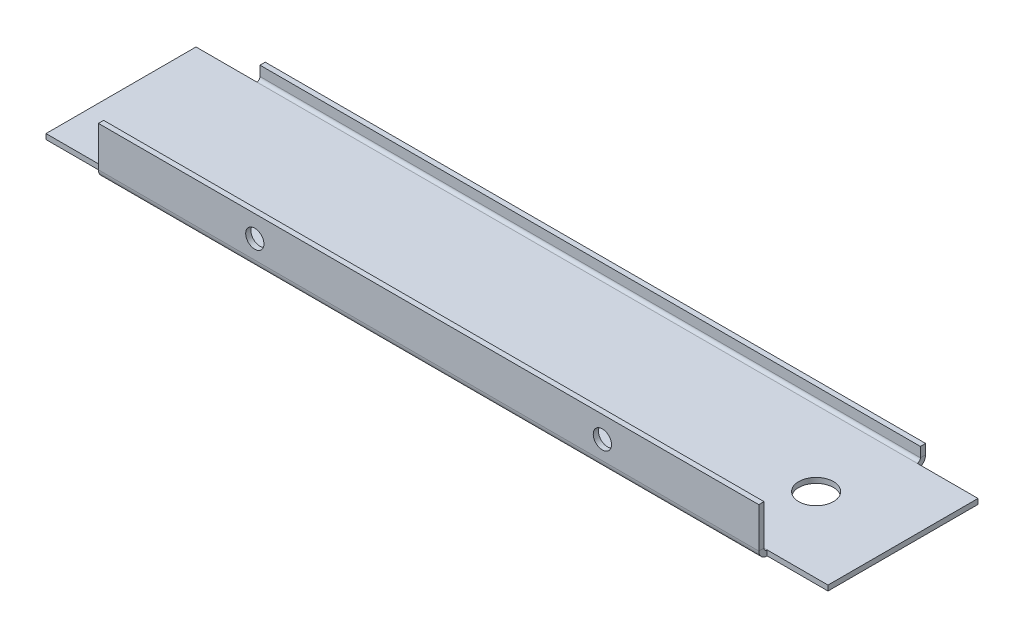
ISO-10303-21;
HEADER;
FILE_DESCRIPTION(('STEP AP214'),'2;1');
FILE_NAME('part.step','',(''),(''),'','','');
FILE_SCHEMA(('AUTOMOTIVE_DESIGN { 1 0 10303 214 1 1 1 1 }'));
ENDSEC;
DATA;
#1=APPLICATION_CONTEXT('core data for automotive mechanical design processes');
#2=APPLICATION_PROTOCOL_DEFINITION('international standard','automotive_design',2000,#1);
#3=PRODUCT_CONTEXT('',#1,'mechanical');
#4=PRODUCT('Part','Part','',(#3));
#5=PRODUCT_RELATED_PRODUCT_CATEGORY('part','',(#4));
#6=PRODUCT_DEFINITION_FORMATION('','',#4);
#7=PRODUCT_DEFINITION_CONTEXT('part definition',#1,'design');
#8=PRODUCT_DEFINITION('design','',#6,#7);
#9=PRODUCT_DEFINITION_SHAPE('','',#8);
#10=(LENGTH_UNIT() NAMED_UNIT(*) SI_UNIT(.MILLI.,.METRE.));
#11=(NAMED_UNIT(*) PLANE_ANGLE_UNIT() SI_UNIT($,.RADIAN.));
#12=(NAMED_UNIT(*) SI_UNIT($,.STERADIAN.) SOLID_ANGLE_UNIT());
#13=UNCERTAINTY_MEASURE_WITH_UNIT(LENGTH_MEASURE(1.E-05),#10,'distance_accuracy_value','');
#14=(GEOMETRIC_REPRESENTATION_CONTEXT(3) GLOBAL_UNCERTAINTY_ASSIGNED_CONTEXT((#13)) GLOBAL_UNIT_ASSIGNED_CONTEXT((#10,
#11,#12)) REPRESENTATION_CONTEXT('',''));
#15=CARTESIAN_POINT('',(0.,0.,0.));
#16=DIRECTION('',(0.,0.,1.));
#17=DIRECTION('',(1.,0.,0.));
#18=AXIS2_PLACEMENT_3D('',#15,#16,#17);
#19=CARTESIAN_POINT('',(90.,0.,-19.2));
#20=DIRECTION('',(0.,0.,1.));
#21=DIRECTION('',(0.,-1.,0.));
#22=AXIS2_PLACEMENT_3D('',#19,#20,#21);
#23=PLANE('',#22);
#24=DIRECTION('',(0.,-1.,0.));
#25=VECTOR('',#24,1.);
#26=CARTESIAN_POINT('',(76.,0.,-19.2));
#27=LINE('',#26,#25);
#28=CARTESIAN_POINT('',(76.,3.,-19.2));
#29=VERTEX_POINT('',#28);
#30=CARTESIAN_POINT('',(76.,0.7366,-19.2));
#31=VERTEX_POINT('',#30);
#32=EDGE_CURVE('E172',#29,#31,#27,.T.);
#33=ORIENTED_EDGE('',*,*,#32,.T.);
#34=DIRECTION('',(-1.,0.,0.));
#35=VECTOR('',#34,1.);
#36=CARTESIAN_POINT('',(90.,0.736599999999998,-19.2));
#37=LINE('',#36,#35);
#38=CARTESIAN_POINT('',(-75.9999999999999,0.736599999999998,-19.2));
#39=VERTEX_POINT('',#38);
#40=EDGE_CURVE('E50',#31,#39,#37,.T.);
#41=ORIENTED_EDGE('',*,*,#40,.T.);
#42=DIRECTION('',(0.,-1.,0.));
#43=VECTOR('',#42,1.);
#44=CARTESIAN_POINT('',(-75.9999999999999,0.,-19.2));
#45=LINE('',#44,#43);
#46=CARTESIAN_POINT('',(-75.9999999999999,3.,-19.2));
#47=VERTEX_POINT('',#46);
#48=EDGE_CURVE('E285',#39,#47,#45,.F.);
#49=ORIENTED_EDGE('',*,*,#48,.T.);
#50=DIRECTION('',(-1.,0.,0.));
#51=VECTOR('',#50,1.);
#52=CARTESIAN_POINT('',(90.,3.,-19.2));
#53=LINE('',#52,#51);
#54=EDGE_CURVE('E213',#29,#47,#53,.T.);
#55=ORIENTED_EDGE('',*,*,#54,.F.);
#56=EDGE_LOOP('',(#33,#41,#49,#55));
#57=FACE_BOUND('',#56,.T.);
#58=ADVANCED_FACE('F35',(#57),#23,.F.);
#59=CARTESIAN_POINT('',(90.,3.,-18.));
#60=DIRECTION('',(0.,1.,0.));
#61=DIRECTION('',(0.,0.,1.));
#62=AXIS2_PLACEMENT_3D('',#59,#60,#61);
#63=PLANE('',#62);
#64=DIRECTION('',(-1.,0.,0.));
#65=VECTOR('',#64,1.);
#66=CARTESIAN_POINT('',(90.,3.,-18.));
#67=LINE('',#66,#65);
#68=CARTESIAN_POINT('',(76.,3.,-18.));
#69=VERTEX_POINT('',#68);
#70=CARTESIAN_POINT('',(-76.,3.,-18.));
#71=VERTEX_POINT('',#70);
#72=EDGE_CURVE('E211',#69,#71,#67,.T.);
#73=ORIENTED_EDGE('',*,*,#72,.F.);
#74=DIRECTION('',(0.,0.,-1.));
#75=VECTOR('',#74,1.);
#76=CARTESIAN_POINT('',(76.,3.,-19.2));
#77=LINE('',#76,#75);
#78=EDGE_CURVE('E303',#29,#69,#77,.F.);
#79=ORIENTED_EDGE('',*,*,#78,.F.);
#80=ORIENTED_EDGE('',*,*,#54,.T.);
#81=DIRECTION('',(0.,0.,1.));
#82=VECTOR('',#81,1.);
#83=CARTESIAN_POINT('',(-76.,3.,-18.));
#84=LINE('',#83,#82);
#85=EDGE_CURVE('E279',#71,#47,#84,.F.);
#86=ORIENTED_EDGE('',*,*,#85,.F.);
#87=EDGE_LOOP('',(#73,#79,#80,#86));
#88=FACE_BOUND('',#87,.T.);
#89=ADVANCED_FACE('F385',(#88),#63,.T.);
#90=CARTESIAN_POINT('',(90.,0.,-18.));
#91=DIRECTION('',(0.,0.,1.));
#92=DIRECTION('',(0.,-1.,0.));
#93=AXIS2_PLACEMENT_3D('',#90,#91,#92);
#94=PLANE('',#93);
#95=DIRECTION('',(-1.,0.,0.));
#96=VECTOR('',#95,1.);
#97=CARTESIAN_POINT('',(90.,0.736599999999999,-18.));
#98=LINE('',#97,#96);
#99=CARTESIAN_POINT('',(76.,0.736599999999999,-18.));
#100=VERTEX_POINT('',#99);
#101=CARTESIAN_POINT('',(-76.,0.7366,-18.));
#102=VERTEX_POINT('',#101);
#103=EDGE_CURVE('E209',#100,#102,#98,.T.);
#104=ORIENTED_EDGE('',*,*,#103,.F.);
#105=DIRECTION('',(0.,-1.,0.));
#106=VECTOR('',#105,1.);
#107=CARTESIAN_POINT('',(76.,0.,-18.));
#108=LINE('',#107,#106);
#109=EDGE_CURVE('E305',#69,#100,#108,.T.);
#110=ORIENTED_EDGE('',*,*,#109,.F.);
#111=ORIENTED_EDGE('',*,*,#72,.T.);
#112=DIRECTION('',(0.,1.,0.));
#113=VECTOR('',#112,1.);
#114=CARTESIAN_POINT('',(-76.,0.,-18.));
#115=LINE('',#114,#113);
#116=EDGE_CURVE('E288',#102,#71,#115,.T.);
#117=ORIENTED_EDGE('',*,*,#116,.F.);
#118=EDGE_LOOP('',(#104,#110,#111,#117));
#119=FACE_BOUND('',#118,.T.);
#120=ADVANCED_FACE('F390',(#119),#94,.T.);
#121=CARTESIAN_POINT('',(90.,0.7366,-17.2634));
#122=DIRECTION('',(-1.,0.,0.));
#123=DIRECTION('',(0.,0.,1.));
#124=AXIS2_PLACEMENT_3D('',#121,#122,#123);
#125=CYLINDRICAL_SURFACE('',#124,0.7366);
#126=DIRECTION('',(-1.,0.,0.));
#127=VECTOR('',#126,1.);
#128=CARTESIAN_POINT('',(90.,0.,-17.2634));
#129=LINE('',#128,#127);
#130=CARTESIAN_POINT('',(76.,0.,-17.2634));
#131=VERTEX_POINT('',#130);
#132=CARTESIAN_POINT('',(-76.,0.,-17.2634));
#133=VERTEX_POINT('',#132);
#134=EDGE_CURVE('E205',#131,#133,#129,.T.);
#135=ORIENTED_EDGE('',*,*,#134,.F.);
#136=CARTESIAN_POINT('',(76.,0.7366,-17.2634));
#137=DIRECTION('',(-1.,0.,0.));
#138=DIRECTION('',(0.,0.,1.));
#139=AXIS2_PLACEMENT_3D('',#136,#137,#138);
#140=CIRCLE('',#139,0.7366);
#141=EDGE_CURVE('E171',#100,#131,#140,.T.);
#142=ORIENTED_EDGE('',*,*,#141,.F.);
#143=ORIENTED_EDGE('',*,*,#103,.T.);
#144=CARTESIAN_POINT('',(-76.,0.7366,-17.2634));
#145=DIRECTION('',(1.,0.,0.));
#146=DIRECTION('',(0.,0.,-1.));
#147=AXIS2_PLACEMENT_3D('',#144,#145,#146);
#148=CIRCLE('',#147,0.7366);
#149=EDGE_CURVE('E296',#133,#102,#148,.T.);
#150=ORIENTED_EDGE('',*,*,#149,.F.);
#151=EDGE_LOOP('',(#135,#142,#143,#150));
#152=FACE_BOUND('',#151,.T.);
#153=ADVANCED_FACE('F416',(#152),#125,.F.);
#154=CARTESIAN_POINT('',(90.,0.7366,-17.2634));
#155=DIRECTION('',(-1.,0.,0.));
#156=DIRECTION('',(0.,0.,1.));
#157=AXIS2_PLACEMENT_3D('',#154,#155,#156);
#158=CYLINDRICAL_SURFACE('',#157,1.9366);
#159=CARTESIAN_POINT('',(76.,0.7366,-17.2634));
#160=DIRECTION('',(-1.,0.,0.));
#161=DIRECTION('',(0.,0.,1.));
#162=AXIS2_PLACEMENT_3D('',#159,#160,#161);
#163=CIRCLE('',#162,1.9366);
#164=CARTESIAN_POINT('',(76.,-1.2,-17.2634));
#165=VERTEX_POINT('',#164);
#166=EDGE_CURVE('E169',#31,#165,#163,.T.);
#167=ORIENTED_EDGE('',*,*,#166,.T.);
#168=DIRECTION('',(-1.,0.,0.));
#169=VECTOR('',#168,1.);
#170=CARTESIAN_POINT('',(90.,-1.2,-17.2634));
#171=LINE('',#170,#169);
#172=CARTESIAN_POINT('',(-75.9999999999999,-1.2,-17.2634));
#173=VERTEX_POINT('',#172);
#174=EDGE_CURVE('E162',#165,#173,#171,.T.);
#175=ORIENTED_EDGE('',*,*,#174,.T.);
#176=CARTESIAN_POINT('',(-75.9999999999999,0.7366,-17.2634));
#177=DIRECTION('',(-1.,0.,0.));
#178=DIRECTION('',(0.,0.,1.));
#179=AXIS2_PLACEMENT_3D('',#176,#177,#178);
#180=CIRCLE('',#179,1.9366);
#181=EDGE_CURVE('E295',#173,#39,#180,.F.);
#182=ORIENTED_EDGE('',*,*,#181,.T.);
#183=ORIENTED_EDGE('',*,*,#40,.F.);
#184=EDGE_LOOP('',(#167,#175,#182,#183));
#185=FACE_BOUND('',#184,.T.);
#186=ADVANCED_FACE('F175',(#185),#158,.T.);
#187=CARTESIAN_POINT('',(90.,0.7366,17.2634));
#188=DIRECTION('',(-1.,0.,0.));
#189=DIRECTION('',(0.,0.,1.));
#190=AXIS2_PLACEMENT_3D('',#187,#188,#189);
#191=CYLINDRICAL_SURFACE('',#190,0.7366);
#192=DIRECTION('',(-1.,0.,0.));
#193=VECTOR('',#192,1.);
#194=CARTESIAN_POINT('',(90.,0.,17.2634));
#195=LINE('',#194,#193);
#196=CARTESIAN_POINT('',(76.,0.,17.2634));
#197=VERTEX_POINT('',#196);
#198=CARTESIAN_POINT('',(-76.,0.,17.2634));
#199=VERTEX_POINT('',#198);
#200=EDGE_CURVE('E202',#197,#199,#195,.T.);
#201=ORIENTED_EDGE('',*,*,#200,.T.);
#202=CARTESIAN_POINT('',(-76.,0.7366,17.2634));
#203=DIRECTION('',(1.,0.,0.));
#204=DIRECTION('',(0.,0.,-1.));
#205=AXIS2_PLACEMENT_3D('',#202,#203,#204);
#206=CIRCLE('',#205,0.7366);
#207=CARTESIAN_POINT('',(-76.,0.7366,18.));
#208=VERTEX_POINT('',#207);
#209=EDGE_CURVE('E277',#208,#199,#206,.T.);
#210=ORIENTED_EDGE('',*,*,#209,.F.);
#211=DIRECTION('',(-1.,0.,0.));
#212=VECTOR('',#211,1.);
#213=CARTESIAN_POINT('',(90.,0.7366,18.));
#214=LINE('',#213,#212);
#215=CARTESIAN_POINT('',(76.,0.7366,18.));
#216=VERTEX_POINT('',#215);
#217=EDGE_CURVE('E199',#216,#208,#214,.T.);
#218=ORIENTED_EDGE('',*,*,#217,.F.);
#219=CARTESIAN_POINT('',(76.,0.7366,17.2634));
#220=DIRECTION('',(-1.,0.,0.));
#221=DIRECTION('',(0.,0.,1.));
#222=AXIS2_PLACEMENT_3D('',#219,#220,#221);
#223=CIRCLE('',#222,0.7366);
#224=EDGE_CURVE('E256',#197,#216,#223,.T.);
#225=ORIENTED_EDGE('',*,*,#224,.F.);
#226=EDGE_LOOP('',(#201,#210,#218,#225));
#227=FACE_BOUND('',#226,.T.);
#228=ADVANCED_FACE('F343',(#227),#191,.F.);
#229=CARTESIAN_POINT('',(90.,10.,18.));
#230=DIRECTION('',(0.,0.,-1.));
#231=DIRECTION('',(-1.,0.,0.));
#232=AXIS2_PLACEMENT_3D('',#229,#230,#231);
#233=PLANE('',#232);
#234=CARTESIAN_POINT('',(-40.,5.,18.));
#235=DIRECTION('',(0.,0.,-1.));
#236=DIRECTION('',(-1.,0.,0.));
#237=AXIS2_PLACEMENT_3D('',#234,#235,#236);
#238=CIRCLE('',#237,2.1);
#239=CARTESIAN_POINT('',(-42.1,5.,18.));
#240=VERTEX_POINT('',#239);
#241=EDGE_CURVE('E323',#240,#240,#238,.T.);
#242=ORIENTED_EDGE('',*,*,#241,.F.);
#243=EDGE_LOOP('',(#242));
#244=FACE_BOUND('',#243,.T.);
#245=CARTESIAN_POINT('',(40.,5.,18.));
#246=DIRECTION('',(0.,0.,-1.));
#247=DIRECTION('',(-1.,0.,0.));
#248=AXIS2_PLACEMENT_3D('',#245,#246,#247);
#249=CIRCLE('',#248,2.1);
#250=CARTESIAN_POINT('',(37.9,5.,18.));
#251=VERTEX_POINT('',#250);
#252=EDGE_CURVE('E317',#251,#251,#249,.T.);
#253=ORIENTED_EDGE('',*,*,#252,.F.);
#254=EDGE_LOOP('',(#253));
#255=FACE_BOUND('',#254,.T.);
#256=ORIENTED_EDGE('',*,*,#217,.T.);
#257=DIRECTION('',(0.,-1.,0.));
#258=VECTOR('',#257,1.);
#259=CARTESIAN_POINT('',(-76.,10.,18.));
#260=LINE('',#259,#258);
#261=CARTESIAN_POINT('',(-76.,10.,18.));
#262=VERTEX_POINT('',#261);
#263=EDGE_CURVE('E267',#262,#208,#260,.T.);
#264=ORIENTED_EDGE('',*,*,#263,.F.);
#265=DIRECTION('',(-1.,0.,0.));
#266=VECTOR('',#265,1.);
#267=CARTESIAN_POINT('',(90.,10.,18.));
#268=LINE('',#267,#266);
#269=CARTESIAN_POINT('',(76.,10.,18.));
#270=VERTEX_POINT('',#269);
#271=EDGE_CURVE('E196',#270,#262,#268,.T.);
#272=ORIENTED_EDGE('',*,*,#271,.F.);
#273=DIRECTION('',(0.,1.,0.));
#274=VECTOR('',#273,1.);
#275=CARTESIAN_POINT('',(76.,10.,18.));
#276=LINE('',#275,#274);
#277=EDGE_CURVE('E248',#270,#216,#276,.F.);
#278=ORIENTED_EDGE('',*,*,#277,.T.);
#279=EDGE_LOOP('',(#256,#264,#272,#278));
#280=FACE_BOUND('',#279,.T.);
#281=ADVANCED_FACE('F339',(#244,#255,#280),#233,.T.);
#282=CARTESIAN_POINT('',(90.,10.,19.2));
#283=DIRECTION('',(0.,1.,0.));
#284=DIRECTION('',(0.,0.,1.));
#285=AXIS2_PLACEMENT_3D('',#282,#283,#284);
#286=PLANE('',#285);
#287=ORIENTED_EDGE('',*,*,#271,.T.);
#288=DIRECTION('',(0.,0.,-1.));
#289=VECTOR('',#288,1.);
#290=CARTESIAN_POINT('',(-76.,10.,18.));
#291=LINE('',#290,#289);
#292=CARTESIAN_POINT('',(-76.,10.,19.2));
#293=VERTEX_POINT('',#292);
#294=EDGE_CURVE('E261',#262,#293,#291,.F.);
#295=ORIENTED_EDGE('',*,*,#294,.T.);
#296=DIRECTION('',(-1.,0.,0.));
#297=VECTOR('',#296,1.);
#298=CARTESIAN_POINT('',(90.,10.,19.2));
#299=LINE('',#298,#297);
#300=CARTESIAN_POINT('',(76.,10.,19.2));
#301=VERTEX_POINT('',#300);
#302=EDGE_CURVE('E193',#301,#293,#299,.T.);
#303=ORIENTED_EDGE('',*,*,#302,.F.);
#304=DIRECTION('',(0.,0.,1.));
#305=VECTOR('',#304,1.);
#306=CARTESIAN_POINT('',(76.,10.,19.2));
#307=LINE('',#306,#305);
#308=EDGE_CURVE('E237',#301,#270,#307,.F.);
#309=ORIENTED_EDGE('',*,*,#308,.T.);
#310=EDGE_LOOP('',(#287,#295,#303,#309));
#311=FACE_BOUND('',#310,.T.);
#312=ADVANCED_FACE('F342',(#311),#286,.T.);
#313=CARTESIAN_POINT('',(90.,10.,19.2));
#314=DIRECTION('',(0.,0.,-1.));
#315=DIRECTION('',(-1.,0.,0.));
#316=AXIS2_PLACEMENT_3D('',#313,#314,#315);
#317=PLANE('',#316);
#318=CARTESIAN_POINT('',(-40.,5.,19.2));
#319=DIRECTION('',(0.,0.,-1.));
#320=DIRECTION('',(-1.,0.,0.));
#321=AXIS2_PLACEMENT_3D('',#318,#319,#320);
#322=CIRCLE('',#321,2.1);
#323=CARTESIAN_POINT('',(-42.1,5.,19.2));
#324=VERTEX_POINT('',#323);
#325=EDGE_CURVE('E320',#324,#324,#322,.T.);
#326=ORIENTED_EDGE('',*,*,#325,.T.);
#327=EDGE_LOOP('',(#326));
#328=FACE_BOUND('',#327,.T.);
#329=CARTESIAN_POINT('',(40.,5.,19.2));
#330=DIRECTION('',(0.,0.,-1.));
#331=DIRECTION('',(-1.,0.,0.));
#332=AXIS2_PLACEMENT_3D('',#329,#330,#331);
#333=CIRCLE('',#332,2.1);
#334=CARTESIAN_POINT('',(37.9,5.,19.2));
#335=VERTEX_POINT('',#334);
#336=EDGE_CURVE('E316',#335,#335,#333,.T.);
#337=ORIENTED_EDGE('',*,*,#336,.T.);
#338=EDGE_LOOP('',(#337));
#339=FACE_BOUND('',#338,.T.);
#340=DIRECTION('',(0.,1.,0.));
#341=VECTOR('',#340,1.);
#342=CARTESIAN_POINT('',(-76.,10.,19.2));
#343=LINE('',#342,#341);
#344=CARTESIAN_POINT('',(-75.9999999999999,0.736600000000001,19.2));
#345=VERTEX_POINT('',#344);
#346=EDGE_CURVE('E264',#293,#345,#343,.F.);
#347=ORIENTED_EDGE('',*,*,#346,.T.);
#348=DIRECTION('',(-1.,0.,0.));
#349=VECTOR('',#348,1.);
#350=CARTESIAN_POINT('',(90.,0.7366,19.2));
#351=LINE('',#350,#349);
#352=CARTESIAN_POINT('',(76.,0.736600000000001,19.2));
#353=VERTEX_POINT('',#352);
#354=EDGE_CURVE('E190',#353,#345,#351,.T.);
#355=ORIENTED_EDGE('',*,*,#354,.F.);
#356=DIRECTION('',(0.,-1.,0.));
#357=VECTOR('',#356,1.);
#358=CARTESIAN_POINT('',(76.,0.,19.2));
#359=LINE('',#358,#357);
#360=EDGE_CURVE('E250',#301,#353,#359,.T.);
#361=ORIENTED_EDGE('',*,*,#360,.F.);
#362=ORIENTED_EDGE('',*,*,#302,.T.);
#363=EDGE_LOOP('',(#347,#355,#361,#362));
#364=FACE_BOUND('',#363,.T.);
#365=ADVANCED_FACE('F329',(#328,#339,#364),#317,.F.);
#366=CARTESIAN_POINT('',(90.,0.7366,17.2634));
#367=DIRECTION('',(-1.,0.,0.));
#368=DIRECTION('',(0.,0.,1.));
#369=AXIS2_PLACEMENT_3D('',#366,#367,#368);
#370=CYLINDRICAL_SURFACE('',#369,1.9366);
#371=CARTESIAN_POINT('',(-75.9999999999999,0.7366,17.2634));
#372=DIRECTION('',(-1.,0.,0.));
#373=DIRECTION('',(0.,0.,1.));
#374=AXIS2_PLACEMENT_3D('',#371,#372,#373);
#375=CIRCLE('',#374,1.9366);
#376=CARTESIAN_POINT('',(-75.9999999999999,-1.2,17.2634));
#377=VERTEX_POINT('',#376);
#378=EDGE_CURVE('E276',#345,#377,#375,.F.);
#379=ORIENTED_EDGE('',*,*,#378,.T.);
#380=DIRECTION('',(-1.,0.,0.));
#381=VECTOR('',#380,1.);
#382=CARTESIAN_POINT('',(90.,-1.2,17.2634));
#383=LINE('',#382,#381);
#384=CARTESIAN_POINT('',(76.,-1.2,17.2634));
#385=VERTEX_POINT('',#384);
#386=EDGE_CURVE('E161',#385,#377,#383,.T.);
#387=ORIENTED_EDGE('',*,*,#386,.F.);
#388=CARTESIAN_POINT('',(76.,0.7366,17.2634));
#389=DIRECTION('',(-1.,0.,0.));
#390=DIRECTION('',(0.,0.,1.));
#391=AXIS2_PLACEMENT_3D('',#388,#389,#390);
#392=CIRCLE('',#391,1.9366);
#393=EDGE_CURVE('E255',#385,#353,#392,.T.);
#394=ORIENTED_EDGE('',*,*,#393,.T.);
#395=ORIENTED_EDGE('',*,*,#354,.T.);
#396=EDGE_LOOP('',(#379,#387,#394,#395));
#397=FACE_BOUND('',#396,.T.);
#398=ADVANCED_FACE('F361',(#397),#370,.T.);
#399=CARTESIAN_POINT('',(90.,0.7366,19.2));
#400=DIRECTION('',(1.,0.,0.));
#401=DIRECTION('',(0.,0.,-1.));
#402=AXIS2_PLACEMENT_3D('',#399,#400,#401);
#403=PLANE('',#402);
#404=DIRECTION('',(0.,0.,-1.));
#405=VECTOR('',#404,1.);
#406=CARTESIAN_POINT('',(90.,0.,18.));
#407=LINE('',#406,#405);
#408=CARTESIAN_POINT('',(90.,0.,17.2634));
#409=VERTEX_POINT('',#408);
#410=CARTESIAN_POINT('',(90.,0.,-17.2634));
#411=VERTEX_POINT('',#410);
#412=EDGE_CURVE('E239',#409,#411,#407,.T.);
#413=ORIENTED_EDGE('',*,*,#412,.F.);
#414=DIRECTION('',(0.,-1.,0.));
#415=VECTOR('',#414,1.);
#416=CARTESIAN_POINT('',(90.,0.,17.2634));
#417=LINE('',#416,#415);
#418=CARTESIAN_POINT('',(90.,-1.2,17.2634));
#419=VERTEX_POINT('',#418);
#420=EDGE_CURVE('E11',#409,#419,#417,.T.);
#421=ORIENTED_EDGE('',*,*,#420,.T.);
#422=DIRECTION('',(0.,0.,-1.));
#423=VECTOR('',#422,1.);
#424=CARTESIAN_POINT('',(90.,-1.2,18.));
#425=LINE('',#424,#423);
#426=CARTESIAN_POINT('',(90.,-1.2,-17.2634));
#427=VERTEX_POINT('',#426);
#428=EDGE_CURVE('E183',#419,#427,#425,.T.);
#429=ORIENTED_EDGE('',*,*,#428,.T.);
#430=DIRECTION('',(0.,1.,0.));
#431=VECTOR('',#430,1.);
#432=CARTESIAN_POINT('',(90.,-1.2,-17.2634));
#433=LINE('',#432,#431);
#434=EDGE_CURVE('E156',#427,#411,#433,.T.);
#435=ORIENTED_EDGE('',*,*,#434,.T.);
#436=EDGE_LOOP('',(#413,#421,#429,#435));
#437=FACE_BOUND('',#436,.T.);
#438=ADVANCED_FACE('F37',(#437),#403,.T.);
#439=CARTESIAN_POINT('',(-90.,0.736599999999998,-19.2));
#440=DIRECTION('',(-1.,0.,0.));
#441=DIRECTION('',(0.,0.,1.));
#442=AXIS2_PLACEMENT_3D('',#439,#440,#441);
#443=PLANE('',#442);
#444=DIRECTION('',(0.,0.,-1.));
#445=VECTOR('',#444,1.);
#446=CARTESIAN_POINT('',(-90.,0.,18.));
#447=LINE('',#446,#445);
#448=CARTESIAN_POINT('',(-90.,0.,17.2634));
#449=VERTEX_POINT('',#448);
#450=CARTESIAN_POINT('',(-90.,0.,-17.2634));
#451=VERTEX_POINT('',#450);
#452=EDGE_CURVE('E224',#449,#451,#447,.T.);
#453=ORIENTED_EDGE('',*,*,#452,.T.);
#454=DIRECTION('',(0.,-1.,0.));
#455=VECTOR('',#454,1.);
#456=CARTESIAN_POINT('',(-90.,0.,-17.2634));
#457=LINE('',#456,#455);
#458=CARTESIAN_POINT('',(-89.9999999999999,-1.2,-17.2634));
#459=VERTEX_POINT('',#458);
#460=EDGE_CURVE('E215',#451,#459,#457,.T.);
#461=ORIENTED_EDGE('',*,*,#460,.T.);
#462=DIRECTION('',(0.,0.,-1.));
#463=VECTOR('',#462,1.);
#464=CARTESIAN_POINT('',(-90.,-1.2,18.));
#465=LINE('',#464,#463);
#466=CARTESIAN_POINT('',(-90.,-1.2,17.2634));
#467=VERTEX_POINT('',#466);
#468=EDGE_CURVE('E225',#467,#459,#465,.T.);
#469=ORIENTED_EDGE('',*,*,#468,.F.);
#470=DIRECTION('',(0.,1.,0.));
#471=VECTOR('',#470,1.);
#472=CARTESIAN_POINT('',(-90.,-1.2,17.2634));
#473=LINE('',#472,#471);
#474=EDGE_CURVE('E43',#467,#449,#473,.T.);
#475=ORIENTED_EDGE('',*,*,#474,.T.);
#476=EDGE_LOOP('',(#453,#461,#469,#475));
#477=FACE_BOUND('',#476,.T.);
#478=ADVANCED_FACE('F223',(#477),#443,.T.);
#479=CARTESIAN_POINT('',(90.,0.,18.));
#480=DIRECTION('',(0.,1.,0.));
#481=DIRECTION('',(0.,0.,1.));
#482=AXIS2_PLACEMENT_3D('',#479,#480,#481);
#483=PLANE('',#482);
#484=CARTESIAN_POINT('',(70.,0.,0.));
#485=DIRECTION('',(0.,1.,0.));
#486=DIRECTION('',(0.,0.,1.));
#487=AXIS2_PLACEMENT_3D('',#484,#485,#486);
#488=CIRCLE('',#487,4.00000000000001);
#489=CARTESIAN_POINT('',(70.,0.,4.00000000000001));
#490=VERTEX_POINT('',#489);
#491=EDGE_CURVE('E309',#490,#490,#488,.T.);
#492=ORIENTED_EDGE('',*,*,#491,.F.);
#493=EDGE_LOOP('',(#492));
#494=FACE_BOUND('',#493,.T.);
#495=ORIENTED_EDGE('',*,*,#452,.F.);
#496=DIRECTION('',(-1.,0.,0.));
#497=VECTOR('',#496,1.);
#498=CARTESIAN_POINT('',(90.,0.,17.2634));
#499=LINE('',#498,#497);
#500=EDGE_CURVE('E233',#199,#449,#499,.T.);
#501=ORIENTED_EDGE('',*,*,#500,.F.);
#502=ORIENTED_EDGE('',*,*,#200,.F.);
#503=EDGE_CURVE('E203',#409,#197,#195,.T.);
#504=ORIENTED_EDGE('',*,*,#503,.F.);
#505=ORIENTED_EDGE('',*,*,#412,.T.);
#506=EDGE_CURVE('E206',#411,#131,#129,.T.);
#507=ORIENTED_EDGE('',*,*,#506,.T.);
#508=ORIENTED_EDGE('',*,*,#134,.T.);
#509=DIRECTION('',(-1.,0.,0.));
#510=VECTOR('',#509,1.);
#511=CARTESIAN_POINT('',(90.,0.,-17.2634));
#512=LINE('',#511,#510);
#513=EDGE_CURVE('E236',#133,#451,#512,.T.);
#514=ORIENTED_EDGE('',*,*,#513,.T.);
#515=EDGE_LOOP('',(#495,#501,#502,#504,#505,#507,#508,#514));
#516=FACE_BOUND('',#515,.T.);
#517=ADVANCED_FACE('F231',(#494,#516),#483,.T.);
#518=CARTESIAN_POINT('',(90.,-1.2,18.));
#519=DIRECTION('',(0.,1.,0.));
#520=DIRECTION('',(0.,0.,1.));
#521=AXIS2_PLACEMENT_3D('',#518,#519,#520);
#522=PLANE('',#521);
#523=CARTESIAN_POINT('',(70.,-1.2,0.));
#524=DIRECTION('',(0.,-1.,0.));
#525=DIRECTION('',(0.,0.,-1.));
#526=AXIS2_PLACEMENT_3D('',#523,#524,#525);
#527=CIRCLE('',#526,4.00000000000001);
#528=CARTESIAN_POINT('',(70.,-1.2,-4.00000000000001));
#529=VERTEX_POINT('',#528);
#530=EDGE_CURVE('E313',#529,#529,#527,.T.);
#531=ORIENTED_EDGE('',*,*,#530,.F.);
#532=EDGE_LOOP('',(#531));
#533=FACE_BOUND('',#532,.T.);
#534=ORIENTED_EDGE('',*,*,#468,.T.);
#535=DIRECTION('',(-1.,0.,0.));
#536=VECTOR('',#535,1.);
#537=CARTESIAN_POINT('',(90.,-1.2,-17.2634));
#538=LINE('',#537,#536);
#539=EDGE_CURVE('E182',#173,#459,#538,.T.);
#540=ORIENTED_EDGE('',*,*,#539,.F.);
#541=ORIENTED_EDGE('',*,*,#174,.F.);
#542=EDGE_CURVE('E150',#427,#165,#171,.T.);
#543=ORIENTED_EDGE('',*,*,#542,.F.);
#544=ORIENTED_EDGE('',*,*,#428,.F.);
#545=EDGE_CURVE('E187',#419,#385,#383,.T.);
#546=ORIENTED_EDGE('',*,*,#545,.T.);
#547=ORIENTED_EDGE('',*,*,#386,.T.);
#548=DIRECTION('',(-1.,0.,0.));
#549=VECTOR('',#548,1.);
#550=CARTESIAN_POINT('',(90.,-1.2,17.2634));
#551=LINE('',#550,#549);
#552=EDGE_CURVE('E274',#377,#467,#551,.T.);
#553=ORIENTED_EDGE('',*,*,#552,.T.);
#554=EDGE_LOOP('',(#534,#540,#541,#543,#544,#546,#547,#553));
#555=FACE_BOUND('',#554,.T.);
#556=ADVANCED_FACE('F181',(#533,#555),#522,.F.);
#557=CARTESIAN_POINT('',(76.,0.,19.2));
#558=DIRECTION('',(1.,0.,0.));
#559=DIRECTION('',(0.,-1.,0.));
#560=AXIS2_PLACEMENT_3D('',#557,#558,#559);
#561=PLANE('',#560);
#562=ORIENTED_EDGE('',*,*,#308,.F.);
#563=ORIENTED_EDGE('',*,*,#360,.T.);
#564=DIRECTION('',(0.,0.,1.));
#565=VECTOR('',#564,1.);
#566=CARTESIAN_POINT('',(76.,0.7366,19.2));
#567=LINE('',#566,#565);
#568=EDGE_CURVE('E241',#353,#216,#567,.F.);
#569=ORIENTED_EDGE('',*,*,#568,.T.);
#570=ORIENTED_EDGE('',*,*,#277,.F.);
#571=EDGE_LOOP('',(#562,#563,#569,#570));
#572=FACE_BOUND('',#571,.T.);
#573=ADVANCED_FACE('F370',(#572),#561,.T.);
#574=CARTESIAN_POINT('',(83.,0.,17.2634));
#575=DIRECTION('',(0.,0.,1.));
#576=DIRECTION('',(-1.,0.,0.));
#577=AXIS2_PLACEMENT_3D('',#574,#575,#576);
#578=PLANE('',#577);
#579=ORIENTED_EDGE('',*,*,#420,.F.);
#580=ORIENTED_EDGE('',*,*,#503,.T.);
#581=DIRECTION('',(0.,1.,0.));
#582=VECTOR('',#581,1.);
#583=CARTESIAN_POINT('',(76.,0.,17.2634));
#584=LINE('',#583,#582);
#585=EDGE_CURVE('E58',#197,#385,#584,.F.);
#586=ORIENTED_EDGE('',*,*,#585,.T.);
#587=ORIENTED_EDGE('',*,*,#545,.F.);
#588=EDGE_LOOP('',(#579,#580,#586,#587));
#589=FACE_BOUND('',#588,.T.);
#590=ADVANCED_FACE('F375',(#589),#578,.T.);
#591=CARTESIAN_POINT('',(76.,0.7366,17.2634));
#592=DIRECTION('',(1.,0.,0.));
#593=DIRECTION('',(0.,0.,-1.));
#594=AXIS2_PLACEMENT_3D('',#591,#592,#593);
#595=PLANE('',#594);
#596=ORIENTED_EDGE('',*,*,#568,.F.);
#597=ORIENTED_EDGE('',*,*,#393,.F.);
#598=ORIENTED_EDGE('',*,*,#585,.F.);
#599=ORIENTED_EDGE('',*,*,#224,.T.);
#600=EDGE_LOOP('',(#596,#597,#598,#599));
#601=FACE_BOUND('',#600,.T.);
#602=ADVANCED_FACE('F373',(#601),#595,.T.);
#603=CARTESIAN_POINT('',(-76.,10.,18.));
#604=DIRECTION('',(1.,0.,0.));
#605=DIRECTION('',(0.,-1.,0.));
#606=AXIS2_PLACEMENT_3D('',#603,#604,#605);
#607=PLANE('',#606);
#608=ORIENTED_EDGE('',*,*,#263,.T.);
#609=DIRECTION('',(0.,0.,-1.));
#610=VECTOR('',#609,1.);
#611=CARTESIAN_POINT('',(-76.,0.7366,18.));
#612=LINE('',#611,#610);
#613=EDGE_CURVE('E258',#208,#345,#612,.F.);
#614=ORIENTED_EDGE('',*,*,#613,.T.);
#615=ORIENTED_EDGE('',*,*,#346,.F.);
#616=ORIENTED_EDGE('',*,*,#294,.F.);
#617=EDGE_LOOP('',(#608,#614,#615,#616));
#618=FACE_BOUND('',#617,.T.);
#619=ADVANCED_FACE('F364',(#618),#607,.F.);
#620=CARTESIAN_POINT('',(-82.9999999999999,0.,17.2634));
#621=DIRECTION('',(0.,0.,1.));
#622=DIRECTION('',(-1.,0.,0.));
#623=AXIS2_PLACEMENT_3D('',#620,#621,#622);
#624=PLANE('',#623);
#625=DIRECTION('',(0.,1.,0.));
#626=VECTOR('',#625,1.);
#627=CARTESIAN_POINT('',(-76.,0.,17.2634));
#628=LINE('',#627,#626);
#629=EDGE_CURVE('E269',#199,#377,#628,.F.);
#630=ORIENTED_EDGE('',*,*,#629,.F.);
#631=ORIENTED_EDGE('',*,*,#500,.T.);
#632=ORIENTED_EDGE('',*,*,#474,.F.);
#633=ORIENTED_EDGE('',*,*,#552,.F.);
#634=EDGE_LOOP('',(#630,#631,#632,#633));
#635=FACE_BOUND('',#634,.T.);
#636=ADVANCED_FACE('F357',(#635),#624,.T.);
#637=CARTESIAN_POINT('',(-76.,0.7366,17.2634));
#638=DIRECTION('',(-1.,0.,0.));
#639=DIRECTION('',(0.,0.,1.));
#640=AXIS2_PLACEMENT_3D('',#637,#638,#639);
#641=PLANE('',#640);
#642=ORIENTED_EDGE('',*,*,#378,.F.);
#643=ORIENTED_EDGE('',*,*,#613,.F.);
#644=ORIENTED_EDGE('',*,*,#209,.T.);
#645=ORIENTED_EDGE('',*,*,#629,.T.);
#646=EDGE_LOOP('',(#642,#643,#644,#645));
#647=FACE_BOUND('',#646,.T.);
#648=ADVANCED_FACE('F356',(#647),#641,.T.);
#649=CARTESIAN_POINT('',(-76.,0.,-18.));
#650=DIRECTION('',(1.,0.,0.));
#651=DIRECTION('',(0.,1.,0.));
#652=AXIS2_PLACEMENT_3D('',#649,#650,#651);
#653=PLANE('',#652);
#654=ORIENTED_EDGE('',*,*,#116,.T.);
#655=ORIENTED_EDGE('',*,*,#85,.T.);
#656=ORIENTED_EDGE('',*,*,#48,.F.);
#657=DIRECTION('',(0.,0.,1.));
#658=VECTOR('',#657,1.);
#659=CARTESIAN_POINT('',(-76.,0.7366,-18.));
#660=LINE('',#659,#658);
#661=EDGE_CURVE('E283',#102,#39,#660,.F.);
#662=ORIENTED_EDGE('',*,*,#661,.F.);
#663=EDGE_LOOP('',(#654,#655,#656,#662));
#664=FACE_BOUND('',#663,.T.);
#665=ADVANCED_FACE('F424',(#664),#653,.F.);
#666=CARTESIAN_POINT('',(-82.9999999999999,0.,-17.2634));
#667=DIRECTION('',(0.,0.,1.));
#668=DIRECTION('',(-1.,0.,0.));
#669=AXIS2_PLACEMENT_3D('',#666,#667,#668);
#670=PLANE('',#669);
#671=ORIENTED_EDGE('',*,*,#460,.F.);
#672=ORIENTED_EDGE('',*,*,#513,.F.);
#673=DIRECTION('',(0.,1.,0.));
#674=VECTOR('',#673,1.);
#675=CARTESIAN_POINT('',(-76.,0.,-17.2634));
#676=LINE('',#675,#674);
#677=EDGE_CURVE('E291',#133,#173,#676,.F.);
#678=ORIENTED_EDGE('',*,*,#677,.T.);
#679=ORIENTED_EDGE('',*,*,#539,.T.);
#680=EDGE_LOOP('',(#671,#672,#678,#679));
#681=FACE_BOUND('',#680,.T.);
#682=ADVANCED_FACE('F412',(#681),#670,.F.);
#683=CARTESIAN_POINT('',(-76.,0.7366,-17.2634));
#684=DIRECTION('',(-1.,0.,0.));
#685=DIRECTION('',(0.,0.,1.));
#686=AXIS2_PLACEMENT_3D('',#683,#684,#685);
#687=PLANE('',#686);
#688=ORIENTED_EDGE('',*,*,#661,.T.);
#689=ORIENTED_EDGE('',*,*,#181,.F.);
#690=ORIENTED_EDGE('',*,*,#677,.F.);
#691=ORIENTED_EDGE('',*,*,#149,.T.);
#692=EDGE_LOOP('',(#688,#689,#690,#691));
#693=FACE_BOUND('',#692,.T.);
#694=ADVANCED_FACE('F414',(#693),#687,.T.);
#695=CARTESIAN_POINT('',(76.,0.,-19.2));
#696=DIRECTION('',(-1.,0.,0.));
#697=DIRECTION('',(0.,-1.,0.));
#698=AXIS2_PLACEMENT_3D('',#695,#696,#697);
#699=PLANE('',#698);
#700=DIRECTION('',(0.,0.,-1.));
#701=VECTOR('',#700,1.);
#702=CARTESIAN_POINT('',(76.,0.7366,-19.2));
#703=LINE('',#702,#701);
#704=EDGE_CURVE('E300',#31,#100,#703,.F.);
#705=ORIENTED_EDGE('',*,*,#704,.F.);
#706=ORIENTED_EDGE('',*,*,#32,.F.);
#707=ORIENTED_EDGE('',*,*,#78,.T.);
#708=ORIENTED_EDGE('',*,*,#109,.T.);
#709=EDGE_LOOP('',(#705,#706,#707,#708));
#710=FACE_BOUND('',#709,.T.);
#711=ADVANCED_FACE('F429',(#710),#699,.F.);
#712=CARTESIAN_POINT('',(83.,0.,-17.2634));
#713=DIRECTION('',(0.,0.,1.));
#714=DIRECTION('',(-1.,0.,0.));
#715=AXIS2_PLACEMENT_3D('',#712,#713,#714);
#716=PLANE('',#715);
#717=DIRECTION('',(0.,1.,0.));
#718=VECTOR('',#717,1.);
#719=CARTESIAN_POINT('',(76.,0.,-17.2634));
#720=LINE('',#719,#718);
#721=EDGE_CURVE('E153',#131,#165,#720,.F.);
#722=ORIENTED_EDGE('',*,*,#721,.F.);
#723=ORIENTED_EDGE('',*,*,#506,.F.);
#724=ORIENTED_EDGE('',*,*,#434,.F.);
#725=ORIENTED_EDGE('',*,*,#542,.T.);
#726=EDGE_LOOP('',(#722,#723,#724,#725));
#727=FACE_BOUND('',#726,.T.);
#728=ADVANCED_FACE('F152',(#727),#716,.F.);
#729=CARTESIAN_POINT('',(76.,0.7366,-17.2634));
#730=DIRECTION('',(1.,0.,0.));
#731=DIRECTION('',(0.,0.,-1.));
#732=AXIS2_PLACEMENT_3D('',#729,#730,#731);
#733=PLANE('',#732);
#734=ORIENTED_EDGE('',*,*,#166,.F.);
#735=ORIENTED_EDGE('',*,*,#704,.T.);
#736=ORIENTED_EDGE('',*,*,#141,.T.);
#737=ORIENTED_EDGE('',*,*,#721,.T.);
#738=EDGE_LOOP('',(#734,#735,#736,#737));
#739=FACE_BOUND('',#738,.T.);
#740=ADVANCED_FACE('F167',(#739),#733,.T.);
#741=CARTESIAN_POINT('',(70.,10.,0.));
#742=DIRECTION('',(0.,-1.,0.));
#743=DIRECTION('',(0.,0.,-1.));
#744=AXIS2_PLACEMENT_3D('',#741,#742,#743);
#745=CYLINDRICAL_SURFACE('',#744,4.00000000000001);
#746=ORIENTED_EDGE('',*,*,#491,.T.);
#747=EDGE_LOOP('',(#746));
#748=FACE_BOUND('',#747,.T.);
#749=ORIENTED_EDGE('',*,*,#530,.T.);
#750=EDGE_LOOP('',(#749));
#751=FACE_BOUND('',#750,.T.);
#752=ADVANCED_FACE('F485',(#748,#751),#745,.F.);
#753=CARTESIAN_POINT('',(40.,5.,19.2));
#754=DIRECTION('',(0.,0.,-1.));
#755=DIRECTION('',(-1.,0.,0.));
#756=AXIS2_PLACEMENT_3D('',#753,#754,#755);
#757=CYLINDRICAL_SURFACE('',#756,2.1);
#758=ORIENTED_EDGE('',*,*,#336,.F.);
#759=EDGE_LOOP('',(#758));
#760=FACE_BOUND('',#759,.T.);
#761=ORIENTED_EDGE('',*,*,#252,.T.);
#762=EDGE_LOOP('',(#761));
#763=FACE_BOUND('',#762,.T.);
#764=ADVANCED_FACE('F335',(#760,#763),#757,.F.);
#765=CARTESIAN_POINT('',(-40.,5.,19.2));
#766=DIRECTION('',(0.,0.,-1.));
#767=DIRECTION('',(-1.,0.,0.));
#768=AXIS2_PLACEMENT_3D('',#765,#766,#767);
#769=CYLINDRICAL_SURFACE('',#768,2.1);
#770=ORIENTED_EDGE('',*,*,#325,.F.);
#771=EDGE_LOOP('',(#770));
#772=FACE_BOUND('',#771,.T.);
#773=ORIENTED_EDGE('',*,*,#241,.T.);
#774=EDGE_LOOP('',(#773));
#775=FACE_BOUND('',#774,.T.);
#776=ADVANCED_FACE('F332',(#772,#775),#769,.F.);
#777=CLOSED_SHELL('',(#58,#89,#120,#153,#186,#228,#281,#312,#365,#398,#438,#478,#517,#556,#573,
#590,#602,#619,#636,#648,#665,#682,#694,#711,#728,#740,#752,#764,#776));
#778=MANIFOLD_SOLID_BREP('B2',#777);
#779=ADVANCED_BREP_SHAPE_REPRESENTATION('',(#18,#778),#14);
#780=SHAPE_DEFINITION_REPRESENTATION(#9,#779);
ENDSEC;
END-ISO-10303-21;
